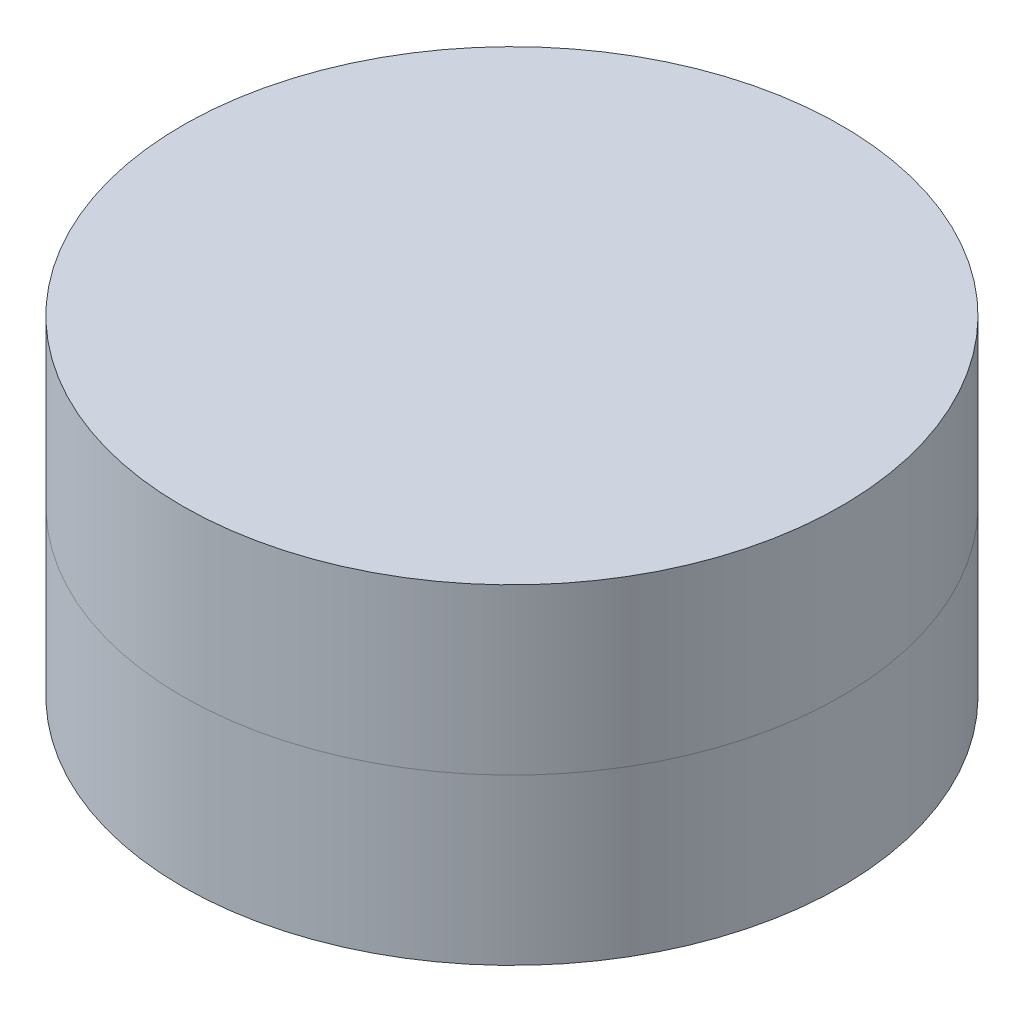
ISO-10303-21;
HEADER;
FILE_DESCRIPTION(('STEP AP214'),'2;1');
FILE_NAME('part.step','',(''),(''),'','','');
FILE_SCHEMA(('AUTOMOTIVE_DESIGN { 1 0 10303 214 1 1 1 1 }'));
ENDSEC;
DATA;
#1=APPLICATION_CONTEXT('core data for automotive mechanical design processes');
#2=APPLICATION_PROTOCOL_DEFINITION('international standard','automotive_design',2000,#1);
#3=PRODUCT_CONTEXT('',#1,'mechanical');
#4=PRODUCT('Part','Part','',(#3));
#5=PRODUCT_RELATED_PRODUCT_CATEGORY('part','',(#4));
#6=PRODUCT_DEFINITION_FORMATION('','',#4);
#7=PRODUCT_DEFINITION_CONTEXT('part definition',#1,'design');
#8=PRODUCT_DEFINITION('design','',#6,#7);
#9=PRODUCT_DEFINITION_SHAPE('','',#8);
#10=(LENGTH_UNIT() NAMED_UNIT(*) SI_UNIT(.MILLI.,.METRE.));
#11=(NAMED_UNIT(*) PLANE_ANGLE_UNIT() SI_UNIT($,.RADIAN.));
#12=(NAMED_UNIT(*) SI_UNIT($,.STERADIAN.) SOLID_ANGLE_UNIT());
#13=UNCERTAINTY_MEASURE_WITH_UNIT(LENGTH_MEASURE(1.E-05),#10,'distance_accuracy_value','');
#14=(GEOMETRIC_REPRESENTATION_CONTEXT(3) GLOBAL_UNCERTAINTY_ASSIGNED_CONTEXT((#13)) GLOBAL_UNIT_ASSIGNED_CONTEXT((#10,
#11,#12)) REPRESENTATION_CONTEXT('',''));
#15=CARTESIAN_POINT('',(0.,0.,0.));
#16=DIRECTION('',(0.,0.,1.));
#17=DIRECTION('',(1.,0.,0.));
#18=AXIS2_PLACEMENT_3D('',#15,#16,#17);
#19=CARTESIAN_POINT('',(0.,2.38125,0.));
#20=DIRECTION('',(0.,-1.,0.));
#21=DIRECTION('',(0.,0.,-1.));
#22=AXIS2_PLACEMENT_3D('',#19,#20,#21);
#23=CYLINDRICAL_SURFACE('',#22,4.7625);
#24=CARTESIAN_POINT('',(0.,2.38125,0.));
#25=DIRECTION('',(0.,1.,0.));
#26=DIRECTION('',(0.,0.,1.));
#27=AXIS2_PLACEMENT_3D('',#24,#25,#26);
#28=CIRCLE('',#27,4.7625);
#29=CARTESIAN_POINT('',(0.,2.38125,4.7625));
#30=VERTEX_POINT('',#29);
#31=EDGE_CURVE('E47',#30,#30,#28,.T.);
#32=ORIENTED_EDGE('',*,*,#31,.F.);
#33=EDGE_LOOP('',(#32));
#34=FACE_BOUND('',#33,.T.);
#35=CARTESIAN_POINT('',(0.,0.,0.));
#36=DIRECTION('',(0.,1.,0.));
#37=DIRECTION('',(0.,0.,1.));
#38=AXIS2_PLACEMENT_3D('',#35,#36,#37);
#39=CIRCLE('',#38,4.7625);
#40=CARTESIAN_POINT('',(0.,0.,4.7625));
#41=VERTEX_POINT('',#40);
#42=EDGE_CURVE('E11',#41,#41,#39,.T.);
#43=ORIENTED_EDGE('',*,*,#42,.T.);
#44=EDGE_LOOP('',(#43));
#45=FACE_BOUND('',#44,.T.);
#46=ADVANCED_FACE('F39',(#34,#45),#23,.T.);
#47=ORIENTED_EDGE('',*,*,#42,.F.);
#48=EDGE_LOOP('',(#47));
#49=FACE_BOUND('',#48,.T.);
#50=CARTESIAN_POINT('',(0.,-2.38125,0.));
#51=DIRECTION('',(0.,1.,0.));
#52=DIRECTION('',(0.,0.,1.));
#53=AXIS2_PLACEMENT_3D('',#50,#51,#52);
#54=CIRCLE('',#53,4.7625);
#55=CARTESIAN_POINT('',(0.,-2.38125,4.7625));
#56=VERTEX_POINT('',#55);
#57=EDGE_CURVE('E53',#56,#56,#54,.T.);
#58=ORIENTED_EDGE('',*,*,#57,.T.);
#59=EDGE_LOOP('',(#58));
#60=FACE_BOUND('',#59,.T.);
#61=ADVANCED_FACE('F41',(#49,#60),#23,.T.);
#62=CARTESIAN_POINT('',(0.,2.38125,0.));
#63=DIRECTION('',(0.,1.,0.));
#64=DIRECTION('',(0.,0.,1.));
#65=AXIS2_PLACEMENT_3D('',#62,#63,#64);
#66=PLANE('',#65);
#67=ORIENTED_EDGE('',*,*,#31,.T.);
#68=EDGE_LOOP('',(#67));
#69=FACE_BOUND('',#68,.T.);
#70=ADVANCED_FACE('F63',(#69),#66,.T.);
#71=CARTESIAN_POINT('',(0.,-2.38125,0.));
#72=DIRECTION('',(0.,1.,0.));
#73=DIRECTION('',(0.,0.,1.));
#74=AXIS2_PLACEMENT_3D('',#71,#72,#73);
#75=PLANE('',#74);
#76=ORIENTED_EDGE('',*,*,#57,.F.);
#77=EDGE_LOOP('',(#76));
#78=FACE_BOUND('',#77,.T.);
#79=ADVANCED_FACE('F61',(#78),#75,.F.);
#80=CLOSED_SHELL('',(#46,#61,#70,#79));
#81=MANIFOLD_SOLID_BREP('B2',#80);
#82=ADVANCED_BREP_SHAPE_REPRESENTATION('',(#18,#81),#14);
#83=SHAPE_DEFINITION_REPRESENTATION(#9,#82);
ENDSEC;
END-ISO-10303-21;
